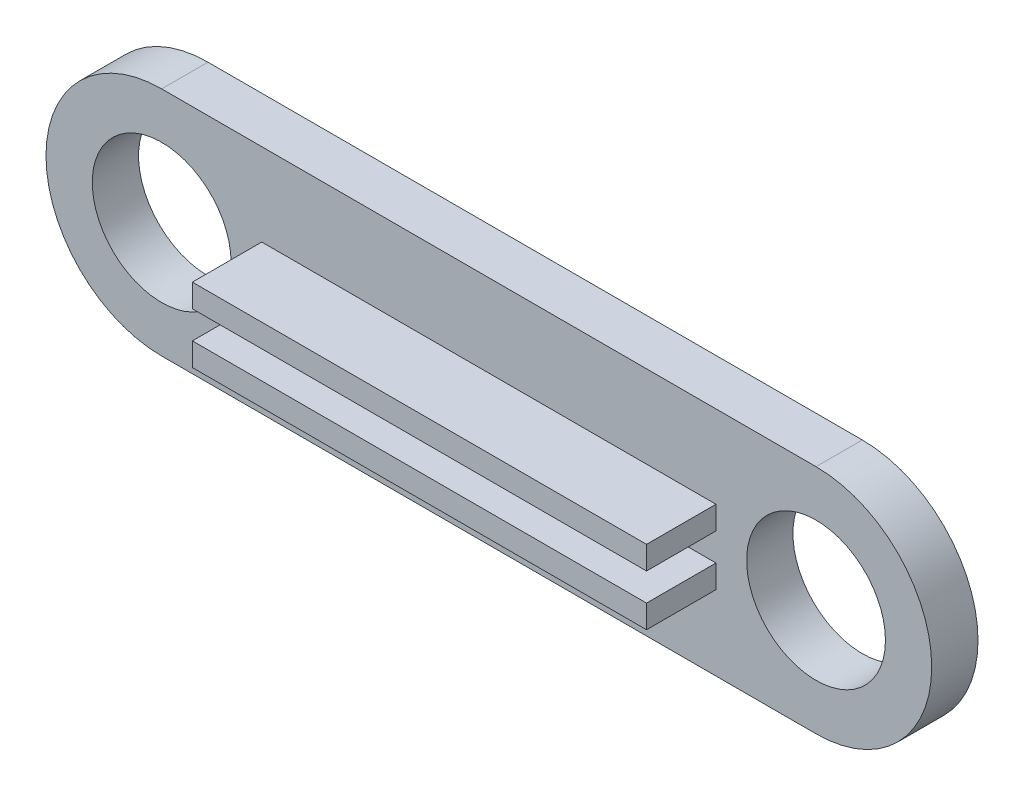
ISO-10303-21;
HEADER;
FILE_DESCRIPTION(('STEP AP214'),'2;1');
FILE_NAME('part.step','',(''),(''),'','','');
FILE_SCHEMA(('AUTOMOTIVE_DESIGN { 1 0 10303 214 1 1 1 1 }'));
ENDSEC;
DATA;
#1=APPLICATION_CONTEXT('core data for automotive mechanical design processes');
#2=APPLICATION_PROTOCOL_DEFINITION('international standard','automotive_design',2000,#1);
#3=PRODUCT_CONTEXT('',#1,'mechanical');
#4=PRODUCT('Part','Part','',(#3));
#5=PRODUCT_RELATED_PRODUCT_CATEGORY('part','',(#4));
#6=PRODUCT_DEFINITION_FORMATION('','',#4);
#7=PRODUCT_DEFINITION_CONTEXT('part definition',#1,'design');
#8=PRODUCT_DEFINITION('design','',#6,#7);
#9=PRODUCT_DEFINITION_SHAPE('','',#8);
#10=(LENGTH_UNIT() NAMED_UNIT(*) SI_UNIT(.MILLI.,.METRE.));
#11=(NAMED_UNIT(*) PLANE_ANGLE_UNIT() SI_UNIT($,.RADIAN.));
#12=(NAMED_UNIT(*) SI_UNIT($,.STERADIAN.) SOLID_ANGLE_UNIT());
#13=UNCERTAINTY_MEASURE_WITH_UNIT(LENGTH_MEASURE(1.E-05),#10,'distance_accuracy_value','');
#14=(GEOMETRIC_REPRESENTATION_CONTEXT(3) GLOBAL_UNCERTAINTY_ASSIGNED_CONTEXT((#13)) GLOBAL_UNIT_ASSIGNED_CONTEXT((#10,
#11,#12)) REPRESENTATION_CONTEXT('',''));
#15=CARTESIAN_POINT('',(0.,0.,0.));
#16=DIRECTION('',(0.,0.,1.));
#17=DIRECTION('',(1.,0.,0.));
#18=AXIS2_PLACEMENT_3D('',#15,#16,#17);
#19=CARTESIAN_POINT('',(-28.4694242291152,-1.45867541798017,6.35));
#20=DIRECTION('',(-1.,0.,0.));
#21=DIRECTION('',(0.,0.,1.));
#22=AXIS2_PLACEMENT_3D('',#19,#20,#21);
#23=PLANE('',#22);
#24=DIRECTION('',(0.,1.,0.));
#25=VECTOR('',#24,1.);
#26=CARTESIAN_POINT('',(-28.4694242291152,0.151703599840402,6.35));
#27=LINE('',#26,#25);
#28=CARTESIAN_POINT('',(-28.4694242291152,-0.824344910543393,6.35));
#29=VERTEX_POINT('',#28);
#30=CARTESIAN_POINT('',(-28.4694242291152,-2.09300592541695,6.35));
#31=VERTEX_POINT('',#30);
#32=EDGE_CURVE('E125',#29,#31,#27,.F.);
#33=ORIENTED_EDGE('',*,*,#32,.F.);
#34=DIRECTION('',(0.,0.,1.));
#35=VECTOR('',#34,1.);
#36=CARTESIAN_POINT('',(-28.4694242291152,-0.824344910543393,6.35));
#37=LINE('',#36,#35);
#38=CARTESIAN_POINT('',(-28.4694242291152,-0.824344910543393,2.54));
#39=VERTEX_POINT('',#38);
#40=EDGE_CURVE('E141',#39,#29,#37,.T.);
#41=ORIENTED_EDGE('',*,*,#40,.F.);
#42=DIRECTION('',(0.,1.,0.));
#43=VECTOR('',#42,1.);
#44=CARTESIAN_POINT('',(-28.4694242291152,-1.45867541798017,2.54));
#45=LINE('',#44,#43);
#46=CARTESIAN_POINT('',(-28.4694242291152,-2.09300592541695,2.54));
#47=VERTEX_POINT('',#46);
#48=EDGE_CURVE('E153',#39,#47,#45,.F.);
#49=ORIENTED_EDGE('',*,*,#48,.T.);
#50=DIRECTION('',(0.,0.,-1.));
#51=VECTOR('',#50,1.);
#52=CARTESIAN_POINT('',(-28.4694242291152,-2.09300592541695,6.35));
#53=LINE('',#52,#51);
#54=EDGE_CURVE('E139',#31,#47,#53,.T.);
#55=ORIENTED_EDGE('',*,*,#54,.F.);
#56=EDGE_LOOP('',(#33,#41,#49,#55));
#57=FACE_BOUND('',#56,.T.);
#58=ADVANCED_FACE('F17',(#57),#23,.T.);
#59=CARTESIAN_POINT('',(-16.0051723942161,0.151703599840402,6.35));
#60=DIRECTION('',(0.,0.,1.));
#61=DIRECTION('',(1.,0.,0.));
#62=AXIS2_PLACEMENT_3D('',#59,#60,#61);
#63=PLANE('',#62);
#64=DIRECTION('',(1.,0.,0.));
#65=VECTOR('',#64,1.);
#66=CARTESIAN_POINT('',(-16.0051723942161,-0.824344910543393,6.35));
#67=LINE('',#66,#65);
#68=CARTESIAN_POINT('',(-3.54092055931687,-0.824344910543393,6.35));
#69=VERTEX_POINT('',#68);
#70=EDGE_CURVE('E204',#29,#69,#67,.T.);
#71=ORIENTED_EDGE('',*,*,#70,.F.);
#72=ORIENTED_EDGE('',*,*,#32,.T.);
#73=DIRECTION('',(1.,0.,0.));
#74=VECTOR('',#73,1.);
#75=CARTESIAN_POINT('',(-16.0051723942161,-2.09300592541695,6.35));
#76=LINE('',#75,#74);
#77=CARTESIAN_POINT('',(-3.54092055931687,-2.09300592541695,6.35));
#78=VERTEX_POINT('',#77);
#79=EDGE_CURVE('E131',#78,#31,#76,.F.);
#80=ORIENTED_EDGE('',*,*,#79,.F.);
#81=DIRECTION('',(0.,1.,0.));
#82=VECTOR('',#81,1.);
#83=CARTESIAN_POINT('',(-3.54092055931687,-1.45867541798017,6.35));
#84=LINE('',#83,#82);
#85=EDGE_CURVE('E114',#78,#69,#84,.T.);
#86=ORIENTED_EDGE('',*,*,#85,.T.);
#87=EDGE_LOOP('',(#71,#72,#80,#86));
#88=FACE_BOUND('',#87,.T.);
#89=ADVANCED_FACE('F137',(#88),#63,.T.);
#90=CARTESIAN_POINT('',(-3.54092055931687,-1.45867541798017,6.35));
#91=DIRECTION('',(-1.,0.,0.));
#92=DIRECTION('',(0.,0.,1.));
#93=AXIS2_PLACEMENT_3D('',#90,#91,#92);
#94=PLANE('',#93);
#95=DIRECTION('',(0.,0.,1.));
#96=VECTOR('',#95,1.);
#97=CARTESIAN_POINT('',(-3.54092055931687,-0.824344910543393,6.35));
#98=LINE('',#97,#96);
#99=CARTESIAN_POINT('',(-3.54092055931687,-0.824344910543393,2.54));
#100=VERTEX_POINT('',#99);
#101=EDGE_CURVE('E120',#69,#100,#98,.F.);
#102=ORIENTED_EDGE('',*,*,#101,.F.);
#103=ORIENTED_EDGE('',*,*,#85,.F.);
#104=DIRECTION('',(0.,0.,-1.));
#105=VECTOR('',#104,1.);
#106=CARTESIAN_POINT('',(-3.54092055931687,-2.09300592541695,6.35));
#107=LINE('',#106,#105);
#108=CARTESIAN_POINT('',(-3.54092055931687,-2.09300592541695,2.54));
#109=VERTEX_POINT('',#108);
#110=EDGE_CURVE('E117',#109,#78,#107,.F.);
#111=ORIENTED_EDGE('',*,*,#110,.F.);
#112=DIRECTION('',(0.,1.,0.));
#113=VECTOR('',#112,1.);
#114=CARTESIAN_POINT('',(-3.54092055931687,-1.45867541798017,2.54));
#115=LINE('',#114,#113);
#116=EDGE_CURVE('E124',#100,#109,#115,.F.);
#117=ORIENTED_EDGE('',*,*,#116,.F.);
#118=EDGE_LOOP('',(#102,#103,#111,#117));
#119=FACE_BOUND('',#118,.T.);
#120=ADVANCED_FACE('F116',(#119),#94,.F.);
#121=CARTESIAN_POINT('',(-3.54092055931687,1.33398559689338,6.35));
#122=DIRECTION('',(-1.,0.,0.));
#123=DIRECTION('',(0.,0.,1.));
#124=AXIS2_PLACEMENT_3D('',#121,#122,#123);
#125=PLANE('',#124);
#126=DIRECTION('',(0.,0.,-1.));
#127=VECTOR('',#126,1.);
#128=CARTESIAN_POINT('',(-3.54092055931687,1.96831610433016,6.35));
#129=LINE('',#128,#127);
#130=CARTESIAN_POINT('',(-3.54092055931687,1.96831610433016,2.54));
#131=VERTEX_POINT('',#130);
#132=CARTESIAN_POINT('',(-3.54092055931687,1.96831610433016,6.35));
#133=VERTEX_POINT('',#132);
#134=EDGE_CURVE('E191',#131,#133,#129,.F.);
#135=ORIENTED_EDGE('',*,*,#134,.T.);
#136=DIRECTION('',(0.,1.,0.));
#137=VECTOR('',#136,1.);
#138=CARTESIAN_POINT('',(-3.54092055931687,0.151703599840402,6.35));
#139=LINE('',#138,#137);
#140=CARTESIAN_POINT('',(-3.54092055931687,0.699655089456608,6.35));
#141=VERTEX_POINT('',#140);
#142=EDGE_CURVE('E147',#141,#133,#139,.T.);
#143=ORIENTED_EDGE('',*,*,#142,.F.);
#144=DIRECTION('',(0.,0.,1.));
#145=VECTOR('',#144,1.);
#146=CARTESIAN_POINT('',(-3.54092055931687,0.699655089456608,6.35));
#147=LINE('',#146,#145);
#148=CARTESIAN_POINT('',(-3.54092055931687,0.699655089456608,2.54));
#149=VERTEX_POINT('',#148);
#150=EDGE_CURVE('E194',#141,#149,#147,.F.);
#151=ORIENTED_EDGE('',*,*,#150,.T.);
#152=DIRECTION('',(0.,1.,0.));
#153=VECTOR('',#152,1.);
#154=CARTESIAN_POINT('',(-3.54092055931687,1.33398559689338,2.54));
#155=LINE('',#154,#153);
#156=EDGE_CURVE('E149',#131,#149,#155,.F.);
#157=ORIENTED_EDGE('',*,*,#156,.F.);
#158=EDGE_LOOP('',(#135,#143,#151,#157));
#159=FACE_BOUND('',#158,.T.);
#160=ADVANCED_FACE('F363',(#159),#125,.F.);
#161=CARTESIAN_POINT('',(-16.0051723942161,0.151703599840402,6.35));
#162=DIRECTION('',(0.,0.,1.));
#163=DIRECTION('',(1.,0.,0.));
#164=AXIS2_PLACEMENT_3D('',#161,#162,#163);
#165=PLANE('',#164);
#166=DIRECTION('',(1.,0.,0.));
#167=VECTOR('',#166,1.);
#168=CARTESIAN_POINT('',(-16.0051723942161,1.96831610433016,6.35));
#169=LINE('',#168,#167);
#170=CARTESIAN_POINT('',(-28.4694242291152,1.96831610433016,6.35));
#171=VERTEX_POINT('',#170);
#172=EDGE_CURVE('E188',#133,#171,#169,.F.);
#173=ORIENTED_EDGE('',*,*,#172,.T.);
#174=DIRECTION('',(0.,1.,0.));
#175=VECTOR('',#174,1.);
#176=CARTESIAN_POINT('',(-28.4694242291152,1.33398559689338,6.35));
#177=LINE('',#176,#175);
#178=CARTESIAN_POINT('',(-28.4694242291152,0.699655089456608,6.35));
#179=VERTEX_POINT('',#178);
#180=EDGE_CURVE('E135',#179,#171,#177,.T.);
#181=ORIENTED_EDGE('',*,*,#180,.F.);
#182=DIRECTION('',(1.,0.,0.));
#183=VECTOR('',#182,1.);
#184=CARTESIAN_POINT('',(-16.0051723942161,0.699655089456608,6.35));
#185=LINE('',#184,#183);
#186=EDGE_CURVE('E197',#179,#141,#185,.T.);
#187=ORIENTED_EDGE('',*,*,#186,.T.);
#188=ORIENTED_EDGE('',*,*,#142,.T.);
#189=EDGE_LOOP('',(#173,#181,#187,#188));
#190=FACE_BOUND('',#189,.T.);
#191=ADVANCED_FACE('F354',(#190),#165,.T.);
#192=CARTESIAN_POINT('',(-28.4694242291152,1.33398559689338,6.35));
#193=DIRECTION('',(-1.,0.,0.));
#194=DIRECTION('',(0.,0.,1.));
#195=AXIS2_PLACEMENT_3D('',#192,#193,#194);
#196=PLANE('',#195);
#197=ORIENTED_EDGE('',*,*,#180,.T.);
#198=DIRECTION('',(0.,0.,-1.));
#199=VECTOR('',#198,1.);
#200=CARTESIAN_POINT('',(-28.4694242291152,1.96831610433016,6.35));
#201=LINE('',#200,#199);
#202=CARTESIAN_POINT('',(-28.4694242291152,1.96831610433016,2.54));
#203=VERTEX_POINT('',#202);
#204=EDGE_CURVE('E186',#171,#203,#201,.T.);
#205=ORIENTED_EDGE('',*,*,#204,.T.);
#206=DIRECTION('',(0.,1.,0.));
#207=VECTOR('',#206,1.);
#208=CARTESIAN_POINT('',(-28.4694242291152,1.33398559689338,2.54));
#209=LINE('',#208,#207);
#210=CARTESIAN_POINT('',(-28.4694242291152,0.699655089456608,2.54));
#211=VERTEX_POINT('',#210);
#212=EDGE_CURVE('E66',#203,#211,#209,.F.);
#213=ORIENTED_EDGE('',*,*,#212,.T.);
#214=DIRECTION('',(0.,0.,1.));
#215=VECTOR('',#214,1.);
#216=CARTESIAN_POINT('',(-28.4694242291152,0.699655089456608,6.35));
#217=LINE('',#216,#215);
#218=EDGE_CURVE('E200',#211,#179,#217,.T.);
#219=ORIENTED_EDGE('',*,*,#218,.T.);
#220=EDGE_LOOP('',(#197,#205,#213,#219));
#221=FACE_BOUND('',#220,.T.);
#222=ADVANCED_FACE('F346',(#221),#196,.T.);
#223=CARTESIAN_POINT('',(-16.0051723942161,-2.09300592541695,6.35));
#224=DIRECTION('',(0.,-1.,0.));
#225=DIRECTION('',(0.,0.,-1.));
#226=AXIS2_PLACEMENT_3D('',#223,#224,#225);
#227=PLANE('',#226);
#228=ORIENTED_EDGE('',*,*,#79,.T.);
#229=ORIENTED_EDGE('',*,*,#54,.T.);
#230=DIRECTION('',(1.,0.,0.));
#231=VECTOR('',#230,1.);
#232=CARTESIAN_POINT('',(-16.0051723942161,-2.09300592541695,2.54));
#233=LINE('',#232,#231);
#234=EDGE_CURVE('E134',#109,#47,#233,.F.);
#235=ORIENTED_EDGE('',*,*,#234,.F.);
#236=ORIENTED_EDGE('',*,*,#110,.T.);
#237=EDGE_LOOP('',(#228,#229,#235,#236));
#238=FACE_BOUND('',#237,.T.);
#239=ADVANCED_FACE('F129',(#238),#227,.T.);
#240=CARTESIAN_POINT('',(-16.0051723942161,-0.824344910543393,6.35));
#241=DIRECTION('',(0.,1.,0.));
#242=DIRECTION('',(0.,0.,1.));
#243=AXIS2_PLACEMENT_3D('',#240,#241,#242);
#244=PLANE('',#243);
#245=ORIENTED_EDGE('',*,*,#70,.T.);
#246=ORIENTED_EDGE('',*,*,#101,.T.);
#247=DIRECTION('',(1.,0.,0.));
#248=VECTOR('',#247,1.);
#249=CARTESIAN_POINT('',(-16.0051723942161,-0.824344910543393,2.54));
#250=LINE('',#249,#248);
#251=EDGE_CURVE('E210',#39,#100,#250,.T.);
#252=ORIENTED_EDGE('',*,*,#251,.F.);
#253=ORIENTED_EDGE('',*,*,#40,.T.);
#254=EDGE_LOOP('',(#245,#246,#252,#253));
#255=FACE_BOUND('',#254,.T.);
#256=ADVANCED_FACE('F208',(#255),#244,.T.);
#257=CARTESIAN_POINT('',(-16.0051723942161,0.699655089456608,6.35));
#258=DIRECTION('',(0.,1.,0.));
#259=DIRECTION('',(0.,0.,1.));
#260=AXIS2_PLACEMENT_3D('',#257,#258,#259);
#261=PLANE('',#260);
#262=ORIENTED_EDGE('',*,*,#150,.F.);
#263=ORIENTED_EDGE('',*,*,#186,.F.);
#264=ORIENTED_EDGE('',*,*,#218,.F.);
#265=DIRECTION('',(1.,0.,0.));
#266=VECTOR('',#265,1.);
#267=CARTESIAN_POINT('',(-16.0051723942161,0.699655089456608,2.54));
#268=LINE('',#267,#266);
#269=EDGE_CURVE('E215',#149,#211,#268,.F.);
#270=ORIENTED_EDGE('',*,*,#269,.F.);
#271=EDGE_LOOP('',(#262,#263,#264,#270));
#272=FACE_BOUND('',#271,.T.);
#273=ADVANCED_FACE('F322',(#272),#261,.F.);
#274=CARTESIAN_POINT('',(-16.0051723942161,1.96831610433016,6.35));
#275=DIRECTION('',(0.,-1.,0.));
#276=DIRECTION('',(0.,0.,-1.));
#277=AXIS2_PLACEMENT_3D('',#274,#275,#276);
#278=PLANE('',#277);
#279=ORIENTED_EDGE('',*,*,#204,.F.);
#280=ORIENTED_EDGE('',*,*,#172,.F.);
#281=ORIENTED_EDGE('',*,*,#134,.F.);
#282=DIRECTION('',(1.,0.,0.));
#283=VECTOR('',#282,1.);
#284=CARTESIAN_POINT('',(-16.0051723942161,1.96831610433016,2.54));
#285=LINE('',#284,#283);
#286=EDGE_CURVE('E219',#203,#131,#285,.T.);
#287=ORIENTED_EDGE('',*,*,#286,.F.);
#288=EDGE_LOOP('',(#279,#280,#281,#287));
#289=FACE_BOUND('',#288,.T.);
#290=ADVANCED_FACE('F245',(#289),#278,.F.);
#291=CARTESIAN_POINT('',(-16.0051723942161,0.151703599840402,2.54));
#292=DIRECTION('',(0.,0.,1.));
#293=DIRECTION('',(1.,0.,0.));
#294=AXIS2_PLACEMENT_3D('',#291,#292,#293);
#295=PLANE('',#294);
#296=ORIENTED_EDGE('',*,*,#212,.F.);
#297=ORIENTED_EDGE('',*,*,#286,.T.);
#298=ORIENTED_EDGE('',*,*,#156,.T.);
#299=ORIENTED_EDGE('',*,*,#269,.T.);
#300=EDGE_LOOP('',(#296,#297,#298,#299));
#301=FACE_BOUND('',#300,.T.);
#302=ORIENTED_EDGE('',*,*,#48,.F.);
#303=ORIENTED_EDGE('',*,*,#251,.T.);
#304=ORIENTED_EDGE('',*,*,#116,.T.);
#305=ORIENTED_EDGE('',*,*,#234,.T.);
#306=EDGE_LOOP('',(#302,#303,#304,#305));
#307=FACE_BOUND('',#306,.T.);
#308=CARTESIAN_POINT('',(1.95262760578393,0.151703599840403,2.54));
#309=DIRECTION('',(0.,0.,1.));
#310=DIRECTION('',(1.,0.,0.));
#311=AXIS2_PLACEMENT_3D('',#308,#309,#310);
#312=CIRCLE('',#311,3.81);
#313=CARTESIAN_POINT('',(5.76262760578393,0.151703599840403,2.54));
#314=VERTEX_POINT('',#313);
#315=EDGE_CURVE('E165',#314,#314,#312,.F.);
#316=ORIENTED_EDGE('',*,*,#315,.T.);
#317=EDGE_LOOP('',(#316));
#318=FACE_BOUND('',#317,.T.);
#319=CARTESIAN_POINT('',(-33.962972394216,0.151703599840403,2.54));
#320=DIRECTION('',(0.,0.,1.));
#321=DIRECTION('',(1.,0.,0.));
#322=AXIS2_PLACEMENT_3D('',#319,#320,#321);
#323=CIRCLE('',#322,3.81);
#324=CARTESIAN_POINT('',(-30.152972394216,0.151703599840403,2.54));
#325=VERTEX_POINT('',#324);
#326=EDGE_CURVE('E168',#325,#325,#323,.F.);
#327=ORIENTED_EDGE('',*,*,#326,.T.);
#328=EDGE_LOOP('',(#327));
#329=FACE_BOUND('',#328,.T.);
#330=DIRECTION('',(1.,0.,0.));
#331=VECTOR('',#330,1.);
#332=CARTESIAN_POINT('',(-16.0051723942161,-6.1982964001596,2.54));
#333=LINE('',#332,#331);
#334=CARTESIAN_POINT('',(-33.962972394216,-6.1982964001596,2.54));
#335=VERTEX_POINT('',#334);
#336=CARTESIAN_POINT('',(1.95262760578393,-6.1982964001596,2.54));
#337=VERTEX_POINT('',#336);
#338=EDGE_CURVE('E172',#335,#337,#333,.T.);
#339=ORIENTED_EDGE('',*,*,#338,.T.);
#340=CARTESIAN_POINT('',(1.95262760578393,0.151703599840402,2.54));
#341=DIRECTION('',(0.,0.,1.));
#342=DIRECTION('',(1.,0.,0.));
#343=AXIS2_PLACEMENT_3D('',#340,#341,#342);
#344=CIRCLE('',#343,6.35);
#345=CARTESIAN_POINT('',(1.95262760578393,6.5017035998404,2.54));
#346=VERTEX_POINT('',#345);
#347=EDGE_CURVE('E170',#346,#337,#344,.F.);
#348=ORIENTED_EDGE('',*,*,#347,.F.);
#349=DIRECTION('',(1.,0.,0.));
#350=VECTOR('',#349,1.);
#351=CARTESIAN_POINT('',(-16.0051723942161,6.5017035998404,2.54));
#352=LINE('',#351,#350);
#353=CARTESIAN_POINT('',(-33.962972394216,6.5017035998404,2.54));
#354=VERTEX_POINT('',#353);
#355=EDGE_CURVE('E184',#354,#346,#352,.T.);
#356=ORIENTED_EDGE('',*,*,#355,.F.);
#357=CARTESIAN_POINT('',(-33.962972394216,0.151703599840402,2.54));
#358=DIRECTION('',(0.,0.,1.));
#359=DIRECTION('',(1.,0.,0.));
#360=AXIS2_PLACEMENT_3D('',#357,#358,#359);
#361=CIRCLE('',#360,6.35);
#362=EDGE_CURVE('E20',#335,#354,#361,.F.);
#363=ORIENTED_EDGE('',*,*,#362,.F.);
#364=EDGE_LOOP('',(#339,#348,#356,#363));
#365=FACE_BOUND('',#364,.T.);
#366=ADVANCED_FACE('F213',(#301,#307,#318,#329,#365),#295,.T.);
#367=CARTESIAN_POINT('',(-33.962972394216,0.151703599840402,2.54));
#368=DIRECTION('',(0.,0.,1.));
#369=DIRECTION('',(1.,0.,0.));
#370=AXIS2_PLACEMENT_3D('',#367,#368,#369);
#371=CYLINDRICAL_SURFACE('',#370,6.35);
#372=ORIENTED_EDGE('',*,*,#362,.T.);
#373=DIRECTION('',(0.,0.,1.));
#374=VECTOR('',#373,1.);
#375=CARTESIAN_POINT('',(-33.962972394216,6.5017035998404,2.54));
#376=LINE('',#375,#374);
#377=CARTESIAN_POINT('',(-33.962972394216,6.5017035998404,0.));
#378=VERTEX_POINT('',#377);
#379=EDGE_CURVE('E175',#378,#354,#376,.T.);
#380=ORIENTED_EDGE('',*,*,#379,.F.);
#381=CARTESIAN_POINT('',(-33.962972394216,0.151703599840402,0.));
#382=DIRECTION('',(0.,0.,1.));
#383=DIRECTION('',(1.,0.,0.));
#384=AXIS2_PLACEMENT_3D('',#381,#382,#383);
#385=CIRCLE('',#384,6.35);
#386=CARTESIAN_POINT('',(-33.962972394216,-6.1982964001596,0.));
#387=VERTEX_POINT('',#386);
#388=EDGE_CURVE('E162',#378,#387,#385,.T.);
#389=ORIENTED_EDGE('',*,*,#388,.T.);
#390=DIRECTION('',(0.,0.,1.));
#391=VECTOR('',#390,1.);
#392=CARTESIAN_POINT('',(-33.962972394216,-6.1982964001596,2.54));
#393=LINE('',#392,#391);
#394=EDGE_CURVE('E177',#387,#335,#393,.T.);
#395=ORIENTED_EDGE('',*,*,#394,.T.);
#396=EDGE_LOOP('',(#372,#380,#389,#395));
#397=FACE_BOUND('',#396,.T.);
#398=ADVANCED_FACE('F236',(#397),#371,.T.);
#399=CARTESIAN_POINT('',(-16.0051723942161,-6.1982964001596,2.54));
#400=DIRECTION('',(0.,1.,0.));
#401=DIRECTION('',(0.,0.,1.));
#402=AXIS2_PLACEMENT_3D('',#399,#400,#401);
#403=PLANE('',#402);
#404=DIRECTION('',(0.,0.,1.));
#405=VECTOR('',#404,1.);
#406=CARTESIAN_POINT('',(1.95262760578393,-6.1982964001596,2.54));
#407=LINE('',#406,#405);
#408=CARTESIAN_POINT('',(1.95262760578393,-6.1982964001596,0.));
#409=VERTEX_POINT('',#408);
#410=EDGE_CURVE('E171',#337,#409,#407,.F.);
#411=ORIENTED_EDGE('',*,*,#410,.F.);
#412=ORIENTED_EDGE('',*,*,#338,.F.);
#413=ORIENTED_EDGE('',*,*,#394,.F.);
#414=DIRECTION('',(1.,0.,0.));
#415=VECTOR('',#414,1.);
#416=CARTESIAN_POINT('',(-16.0051723942161,-6.1982964001596,0.));
#417=LINE('',#416,#415);
#418=EDGE_CURVE('E161',#387,#409,#417,.T.);
#419=ORIENTED_EDGE('',*,*,#418,.T.);
#420=EDGE_LOOP('',(#411,#412,#413,#419));
#421=FACE_BOUND('',#420,.T.);
#422=ADVANCED_FACE('F234',(#421),#403,.F.);
#423=CARTESIAN_POINT('',(1.95262760578393,0.151703599840402,2.54));
#424=DIRECTION('',(0.,0.,1.));
#425=DIRECTION('',(1.,0.,0.));
#426=AXIS2_PLACEMENT_3D('',#423,#424,#425);
#427=CYLINDRICAL_SURFACE('',#426,6.35);
#428=ORIENTED_EDGE('',*,*,#347,.T.);
#429=ORIENTED_EDGE('',*,*,#410,.T.);
#430=CARTESIAN_POINT('',(1.95262760578393,0.151703599840402,0.));
#431=DIRECTION('',(0.,0.,1.));
#432=DIRECTION('',(1.,0.,0.));
#433=AXIS2_PLACEMENT_3D('',#430,#431,#432);
#434=CIRCLE('',#433,6.35);
#435=CARTESIAN_POINT('',(1.95262760578393,6.5017035998404,0.));
#436=VERTEX_POINT('',#435);
#437=EDGE_CURVE('E158',#409,#436,#434,.T.);
#438=ORIENTED_EDGE('',*,*,#437,.T.);
#439=DIRECTION('',(0.,0.,1.));
#440=VECTOR('',#439,1.);
#441=CARTESIAN_POINT('',(1.95262760578393,6.5017035998404,2.54));
#442=LINE('',#441,#440);
#443=EDGE_CURVE('E35',#346,#436,#442,.F.);
#444=ORIENTED_EDGE('',*,*,#443,.F.);
#445=EDGE_LOOP('',(#428,#429,#438,#444));
#446=FACE_BOUND('',#445,.T.);
#447=ADVANCED_FACE('F232',(#446),#427,.T.);
#448=CARTESIAN_POINT('',(-16.0051723942161,6.5017035998404,2.54));
#449=DIRECTION('',(0.,1.,0.));
#450=DIRECTION('',(0.,0.,1.));
#451=AXIS2_PLACEMENT_3D('',#448,#449,#450);
#452=PLANE('',#451);
#453=ORIENTED_EDGE('',*,*,#355,.T.);
#454=ORIENTED_EDGE('',*,*,#443,.T.);
#455=DIRECTION('',(1.,0.,0.));
#456=VECTOR('',#455,1.);
#457=CARTESIAN_POINT('',(-16.0051723942161,6.5017035998404,0.));
#458=LINE('',#457,#456);
#459=EDGE_CURVE('E157',#436,#378,#458,.F.);
#460=ORIENTED_EDGE('',*,*,#459,.T.);
#461=ORIENTED_EDGE('',*,*,#379,.T.);
#462=EDGE_LOOP('',(#453,#454,#460,#461));
#463=FACE_BOUND('',#462,.T.);
#464=ADVANCED_FACE('F226',(#463),#452,.T.);
#465=CARTESIAN_POINT('',(-33.962972394216,0.151703599840403,2.54));
#466=DIRECTION('',(0.,0.,1.));
#467=DIRECTION('',(1.,0.,0.));
#468=AXIS2_PLACEMENT_3D('',#465,#466,#467);
#469=CYLINDRICAL_SURFACE('',#468,3.81);
#470=CARTESIAN_POINT('',(-33.962972394216,0.151703599840403,0.));
#471=DIRECTION('',(0.,0.,1.));
#472=DIRECTION('',(1.,0.,0.));
#473=AXIS2_PLACEMENT_3D('',#470,#471,#472);
#474=CIRCLE('',#473,3.81);
#475=CARTESIAN_POINT('',(-30.152972394216,0.151703599840403,0.));
#476=VERTEX_POINT('',#475);
#477=EDGE_CURVE('E26',#476,#476,#474,.F.);
#478=ORIENTED_EDGE('',*,*,#477,.T.);
#479=EDGE_LOOP('',(#478));
#480=FACE_BOUND('',#479,.T.);
#481=ORIENTED_EDGE('',*,*,#326,.F.);
#482=EDGE_LOOP('',(#481));
#483=FACE_BOUND('',#482,.T.);
#484=ADVANCED_FACE('F254',(#480,#483),#469,.F.);
#485=CARTESIAN_POINT('',(1.95262760578393,0.151703599840403,2.54));
#486=DIRECTION('',(0.,0.,1.));
#487=DIRECTION('',(1.,0.,0.));
#488=AXIS2_PLACEMENT_3D('',#485,#486,#487);
#489=CYLINDRICAL_SURFACE('',#488,3.81);
#490=CARTESIAN_POINT('',(1.95262760578393,0.151703599840403,0.));
#491=DIRECTION('',(0.,0.,1.));
#492=DIRECTION('',(1.,0.,0.));
#493=AXIS2_PLACEMENT_3D('',#490,#491,#492);
#494=CIRCLE('',#493,3.81);
#495=CARTESIAN_POINT('',(5.76262760578393,0.151703599840403,0.));
#496=VERTEX_POINT('',#495);
#497=EDGE_CURVE('E11',#496,#496,#494,.F.);
#498=ORIENTED_EDGE('',*,*,#497,.T.);
#499=EDGE_LOOP('',(#498));
#500=FACE_BOUND('',#499,.T.);
#501=ORIENTED_EDGE('',*,*,#315,.F.);
#502=EDGE_LOOP('',(#501));
#503=FACE_BOUND('',#502,.T.);
#504=ADVANCED_FACE('F248',(#500,#503),#489,.F.);
#505=CARTESIAN_POINT('',(-16.0051723942161,0.151703599840402,0.));
#506=DIRECTION('',(0.,0.,1.));
#507=DIRECTION('',(1.,0.,0.));
#508=AXIS2_PLACEMENT_3D('',#505,#506,#507);
#509=PLANE('',#508);
#510=ORIENTED_EDGE('',*,*,#497,.F.);
#511=EDGE_LOOP('',(#510));
#512=FACE_BOUND('',#511,.T.);
#513=ORIENTED_EDGE('',*,*,#477,.F.);
#514=EDGE_LOOP('',(#513));
#515=FACE_BOUND('',#514,.T.);
#516=ORIENTED_EDGE('',*,*,#437,.F.);
#517=ORIENTED_EDGE('',*,*,#418,.F.);
#518=ORIENTED_EDGE('',*,*,#388,.F.);
#519=ORIENTED_EDGE('',*,*,#459,.F.);
#520=EDGE_LOOP('',(#516,#517,#518,#519));
#521=FACE_BOUND('',#520,.T.);
#522=ADVANCED_FACE('F230',(#512,#515,#521),#509,.F.);
#523=CLOSED_SHELL('',(#58,#89,#120,#160,#191,#222,#239,#256,#273,#290,#366,#398,#422,#447,#464,
#484,#504,#522));
#524=MANIFOLD_SOLID_BREP('B1',#523);
#525=ADVANCED_BREP_SHAPE_REPRESENTATION('',(#18,#524),#14);
#526=SHAPE_DEFINITION_REPRESENTATION(#9,#525);
ENDSEC;
END-ISO-10303-21;
